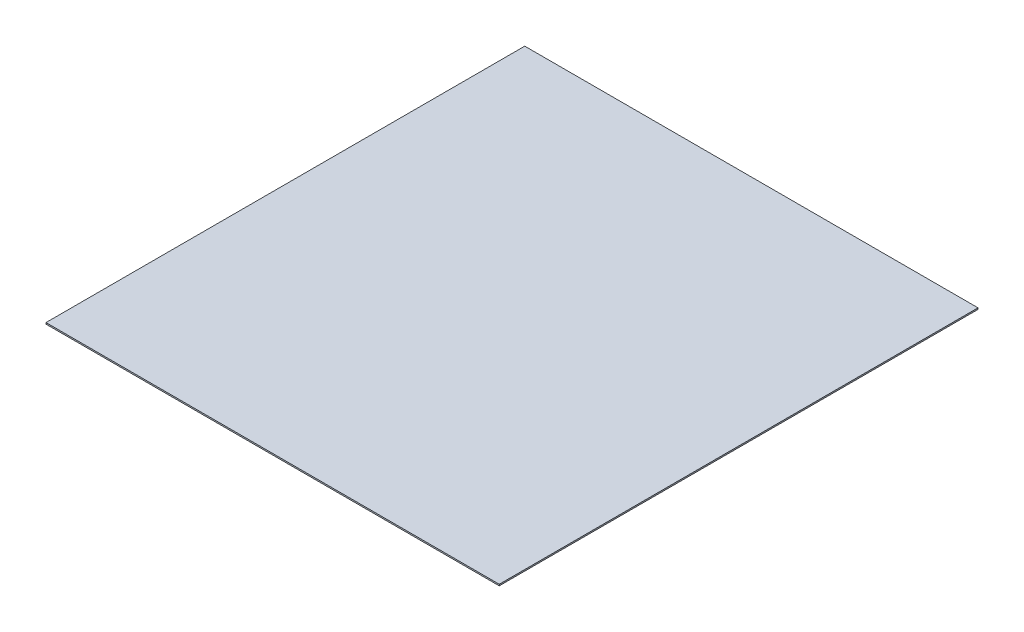
ISO-10303-21;
HEADER;
FILE_DESCRIPTION(('STEP AP214'),'2;1');
FILE_NAME('part.step','',(''),(''),'','','');
FILE_SCHEMA(('AUTOMOTIVE_DESIGN { 1 0 10303 214 1 1 1 1 }'));
ENDSEC;
DATA;
#1=APPLICATION_CONTEXT('core data for automotive mechanical design processes');
#2=APPLICATION_PROTOCOL_DEFINITION('international standard','automotive_design',2000,#1);
#3=PRODUCT_CONTEXT('',#1,'mechanical');
#4=PRODUCT('Part','Part','',(#3));
#5=PRODUCT_RELATED_PRODUCT_CATEGORY('part','',(#4));
#6=PRODUCT_DEFINITION_FORMATION('','',#4);
#7=PRODUCT_DEFINITION_CONTEXT('part definition',#1,'design');
#8=PRODUCT_DEFINITION('design','',#6,#7);
#9=PRODUCT_DEFINITION_SHAPE('','',#8);
#10=(LENGTH_UNIT() NAMED_UNIT(*) SI_UNIT(.MILLI.,.METRE.));
#11=(NAMED_UNIT(*) PLANE_ANGLE_UNIT() SI_UNIT($,.RADIAN.));
#12=(NAMED_UNIT(*) SI_UNIT($,.STERADIAN.) SOLID_ANGLE_UNIT());
#13=UNCERTAINTY_MEASURE_WITH_UNIT(LENGTH_MEASURE(1.E-05),#10,'distance_accuracy_value','');
#14=(GEOMETRIC_REPRESENTATION_CONTEXT(3) GLOBAL_UNCERTAINTY_ASSIGNED_CONTEXT((#13)) GLOBAL_UNIT_ASSIGNED_CONTEXT((#10,
#11,#12)) REPRESENTATION_CONTEXT('',''));
#15=CARTESIAN_POINT('',(0.,0.,0.));
#16=DIRECTION('',(0.,0.,1.));
#17=DIRECTION('',(1.,0.,0.));
#18=AXIS2_PLACEMENT_3D('',#15,#16,#17);
#19=CARTESIAN_POINT('',(0.,3.175,0.));
#20=DIRECTION('',(1.,0.,0.));
#21=DIRECTION('',(0.,0.,-1.));
#22=AXIS2_PLACEMENT_3D('',#19,#20,#21);
#23=PLANE('',#22);
#24=DIRECTION('',(0.,0.,1.));
#25=VECTOR('',#24,1.);
#26=CARTESIAN_POINT('',(0.,0.,0.));
#27=LINE('',#26,#25);
#28=CARTESIAN_POINT('',(0.,0.,-1073.15));
#29=VERTEX_POINT('',#28);
#30=CARTESIAN_POINT('',(0.,0.,0.));
#31=VERTEX_POINT('',#30);
#32=EDGE_CURVE('E95',#29,#31,#27,.T.);
#33=ORIENTED_EDGE('',*,*,#32,.T.);
#34=DIRECTION('',(0.,-1.,0.));
#35=VECTOR('',#34,1.);
#36=CARTESIAN_POINT('',(0.,3.175,0.));
#37=LINE('',#36,#35);
#38=CARTESIAN_POINT('',(0.,3.175,0.));
#39=VERTEX_POINT('',#38);
#40=EDGE_CURVE('E11',#39,#31,#37,.T.);
#41=ORIENTED_EDGE('',*,*,#40,.F.);
#42=DIRECTION('',(0.,0.,1.));
#43=VECTOR('',#42,1.);
#44=CARTESIAN_POINT('',(0.,3.175,0.));
#45=LINE('',#44,#43);
#46=CARTESIAN_POINT('',(0.,3.175,-1073.15));
#47=VERTEX_POINT('',#46);
#48=EDGE_CURVE('E83',#47,#39,#45,.T.);
#49=ORIENTED_EDGE('',*,*,#48,.F.);
#50=DIRECTION('',(0.,-1.,0.));
#51=VECTOR('',#50,1.);
#52=CARTESIAN_POINT('',(0.,3.175,-1073.15));
#53=LINE('',#52,#51);
#54=EDGE_CURVE('E91',#47,#29,#53,.T.);
#55=ORIENTED_EDGE('',*,*,#54,.T.);
#56=EDGE_LOOP('',(#33,#41,#49,#55));
#57=FACE_BOUND('',#56,.T.);
#58=ADVANCED_FACE('F32',(#57),#23,.F.);
#59=CARTESIAN_POINT('',(0.,3.175,0.));
#60=DIRECTION('',(0.,0.,-1.));
#61=DIRECTION('',(-1.,0.,0.));
#62=AXIS2_PLACEMENT_3D('',#59,#60,#61);
#63=PLANE('',#62);
#64=DIRECTION('',(1.,0.,0.));
#65=VECTOR('',#64,1.);
#66=CARTESIAN_POINT('',(0.,0.,0.));
#67=LINE('',#66,#65);
#68=CARTESIAN_POINT('',(1016.,0.,0.));
#69=VERTEX_POINT('',#68);
#70=EDGE_CURVE('E87',#31,#69,#67,.T.);
#71=ORIENTED_EDGE('',*,*,#70,.T.);
#72=DIRECTION('',(0.,-1.,0.));
#73=VECTOR('',#72,1.);
#74=CARTESIAN_POINT('',(1016.,3.175,0.));
#75=LINE('',#74,#73);
#76=CARTESIAN_POINT('',(1016.,3.175,0.));
#77=VERTEX_POINT('',#76);
#78=EDGE_CURVE('E40',#77,#69,#75,.T.);
#79=ORIENTED_EDGE('',*,*,#78,.F.);
#80=DIRECTION('',(1.,0.,0.));
#81=VECTOR('',#80,1.);
#82=CARTESIAN_POINT('',(0.,3.175,0.));
#83=LINE('',#82,#81);
#84=EDGE_CURVE('E78',#39,#77,#83,.T.);
#85=ORIENTED_EDGE('',*,*,#84,.F.);
#86=ORIENTED_EDGE('',*,*,#40,.T.);
#87=EDGE_LOOP('',(#71,#79,#85,#86));
#88=FACE_BOUND('',#87,.T.);
#89=ADVANCED_FACE('F86',(#88),#63,.F.);
#90=CARTESIAN_POINT('',(1016.,3.175,0.));
#91=DIRECTION('',(-1.,0.,0.));
#92=DIRECTION('',(0.,0.,1.));
#93=AXIS2_PLACEMENT_3D('',#90,#91,#92);
#94=PLANE('',#93);
#95=DIRECTION('',(0.,0.,-1.));
#96=VECTOR('',#95,1.);
#97=CARTESIAN_POINT('',(1016.,0.,0.));
#98=LINE('',#97,#96);
#99=CARTESIAN_POINT('',(1016.,0.,-1073.15));
#100=VERTEX_POINT('',#99);
#101=EDGE_CURVE('E65',#69,#100,#98,.T.);
#102=ORIENTED_EDGE('',*,*,#101,.T.);
#103=DIRECTION('',(0.,-1.,0.));
#104=VECTOR('',#103,1.);
#105=CARTESIAN_POINT('',(1016.,3.175,-1073.15));
#106=LINE('',#105,#104);
#107=CARTESIAN_POINT('',(1016.,3.175,-1073.15));
#108=VERTEX_POINT('',#107);
#109=EDGE_CURVE('E88',#108,#100,#106,.T.);
#110=ORIENTED_EDGE('',*,*,#109,.F.);
#111=DIRECTION('',(0.,0.,-1.));
#112=VECTOR('',#111,1.);
#113=CARTESIAN_POINT('',(1016.,3.175,0.));
#114=LINE('',#113,#112);
#115=EDGE_CURVE('E81',#77,#108,#114,.T.);
#116=ORIENTED_EDGE('',*,*,#115,.F.);
#117=ORIENTED_EDGE('',*,*,#78,.T.);
#118=EDGE_LOOP('',(#102,#110,#116,#117));
#119=FACE_BOUND('',#118,.T.);
#120=ADVANCED_FACE('F89',(#119),#94,.F.);
#121=CARTESIAN_POINT('',(0.,3.175,-1073.15));
#122=DIRECTION('',(0.,0.,1.));
#123=DIRECTION('',(1.,0.,0.));
#124=AXIS2_PLACEMENT_3D('',#121,#122,#123);
#125=PLANE('',#124);
#126=DIRECTION('',(-1.,0.,0.));
#127=VECTOR('',#126,1.);
#128=CARTESIAN_POINT('',(0.,0.,-1073.15));
#129=LINE('',#128,#127);
#130=EDGE_CURVE('E71',#100,#29,#129,.T.);
#131=ORIENTED_EDGE('',*,*,#130,.T.);
#132=ORIENTED_EDGE('',*,*,#54,.F.);
#133=DIRECTION('',(-1.,0.,0.));
#134=VECTOR('',#133,1.);
#135=CARTESIAN_POINT('',(0.,3.175,-1073.15));
#136=LINE('',#135,#134);
#137=EDGE_CURVE('E48',#108,#47,#136,.T.);
#138=ORIENTED_EDGE('',*,*,#137,.F.);
#139=ORIENTED_EDGE('',*,*,#109,.T.);
#140=EDGE_LOOP('',(#131,#132,#138,#139));
#141=FACE_BOUND('',#140,.T.);
#142=ADVANCED_FACE('F102',(#141),#125,.F.);
#143=CARTESIAN_POINT('',(0.,3.175,0.));
#144=DIRECTION('',(0.,-1.,0.));
#145=DIRECTION('',(0.,0.,-1.));
#146=AXIS2_PLACEMENT_3D('',#143,#144,#145);
#147=PLANE('',#146);
#148=ORIENTED_EDGE('',*,*,#48,.T.);
#149=ORIENTED_EDGE('',*,*,#84,.T.);
#150=ORIENTED_EDGE('',*,*,#115,.T.);
#151=ORIENTED_EDGE('',*,*,#137,.T.);
#152=EDGE_LOOP('',(#148,#149,#150,#151));
#153=FACE_BOUND('',#152,.T.);
#154=ADVANCED_FACE('F79',(#153),#147,.F.);
#155=CARTESIAN_POINT('',(0.,0.,0.));
#156=DIRECTION('',(0.,-1.,0.));
#157=DIRECTION('',(0.,0.,-1.));
#158=AXIS2_PLACEMENT_3D('',#155,#156,#157);
#159=PLANE('',#158);
#160=ORIENTED_EDGE('',*,*,#32,.F.);
#161=ORIENTED_EDGE('',*,*,#130,.F.);
#162=ORIENTED_EDGE('',*,*,#101,.F.);
#163=ORIENTED_EDGE('',*,*,#70,.F.);
#164=EDGE_LOOP('',(#160,#161,#162,#163));
#165=FACE_BOUND('',#164,.T.);
#166=ADVANCED_FACE('F105',(#165),#159,.T.);
#167=CLOSED_SHELL('',(#58,#89,#120,#142,#154,#166));
#168=MANIFOLD_SOLID_BREP('B2',#167);
#169=ADVANCED_BREP_SHAPE_REPRESENTATION('',(#18,#168),#14);
#170=SHAPE_DEFINITION_REPRESENTATION(#9,#169);
ENDSEC;
END-ISO-10303-21;
